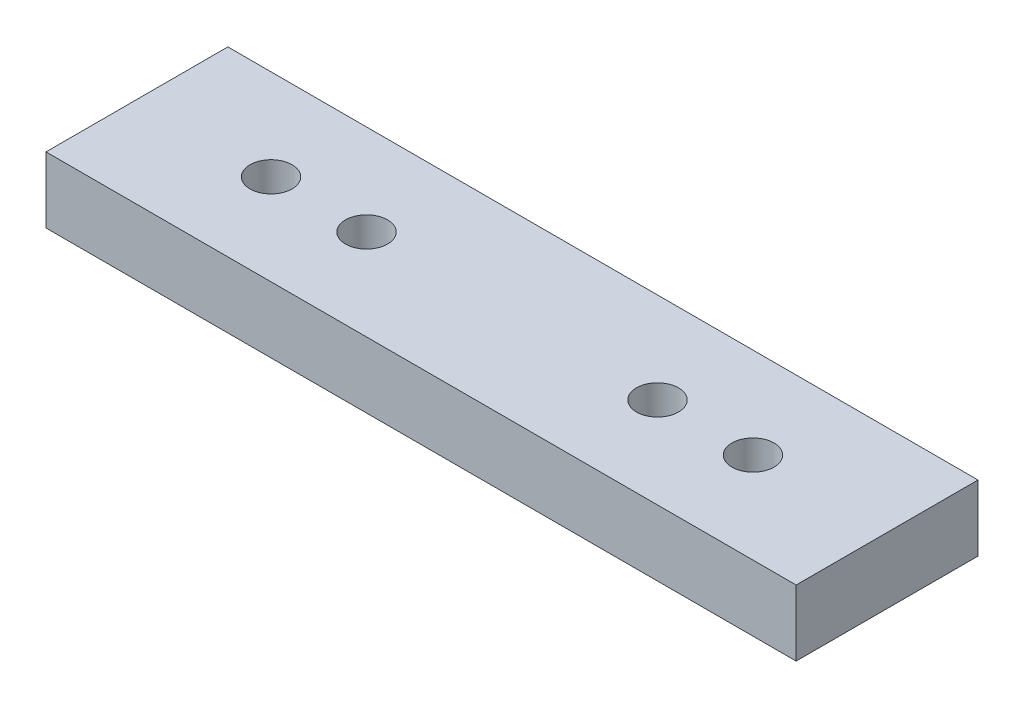
ISO-10303-21;
HEADER;
FILE_DESCRIPTION(('STEP AP214'),'2;1');
FILE_NAME('part.step','',(''),(''),'','','');
FILE_SCHEMA(('AUTOMOTIVE_DESIGN { 1 0 10303 214 1 1 1 1 }'));
ENDSEC;
DATA;
#1=APPLICATION_CONTEXT('core data for automotive mechanical design processes');
#2=APPLICATION_PROTOCOL_DEFINITION('international standard','automotive_design',2000,#1);
#3=PRODUCT_CONTEXT('',#1,'mechanical');
#4=PRODUCT('Part','Part','',(#3));
#5=PRODUCT_RELATED_PRODUCT_CATEGORY('part','',(#4));
#6=PRODUCT_DEFINITION_FORMATION('','',#4);
#7=PRODUCT_DEFINITION_CONTEXT('part definition',#1,'design');
#8=PRODUCT_DEFINITION('design','',#6,#7);
#9=PRODUCT_DEFINITION_SHAPE('','',#8);
#10=(LENGTH_UNIT() NAMED_UNIT(*) SI_UNIT(.MILLI.,.METRE.));
#11=(NAMED_UNIT(*) PLANE_ANGLE_UNIT() SI_UNIT($,.RADIAN.));
#12=(NAMED_UNIT(*) SI_UNIT($,.STERADIAN.) SOLID_ANGLE_UNIT());
#13=UNCERTAINTY_MEASURE_WITH_UNIT(LENGTH_MEASURE(1.E-05),#10,'distance_accuracy_value','');
#14=(GEOMETRIC_REPRESENTATION_CONTEXT(3) GLOBAL_UNCERTAINTY_ASSIGNED_CONTEXT((#13)) GLOBAL_UNIT_ASSIGNED_CONTEXT((#10,
#11,#12)) REPRESENTATION_CONTEXT('',''));
#15=CARTESIAN_POINT('',(0.,0.,0.));
#16=DIRECTION('',(0.,0.,1.));
#17=DIRECTION('',(1.,0.,0.));
#18=AXIS2_PLACEMENT_3D('',#15,#16,#17);
#19=CARTESIAN_POINT('',(20.955,3.683,-5.08));
#20=DIRECTION('',(-1.,0.,0.));
#21=DIRECTION('',(0.,0.,1.));
#22=AXIS2_PLACEMENT_3D('',#19,#20,#21);
#23=PLANE('',#22);
#24=DIRECTION('',(0.,0.,-1.));
#25=VECTOR('',#24,1.);
#26=CARTESIAN_POINT('',(20.955,0.,-5.08));
#27=LINE('',#26,#25);
#28=CARTESIAN_POINT('',(20.955,0.,5.08));
#29=VERTEX_POINT('',#28);
#30=CARTESIAN_POINT('',(20.955,0.,-5.08));
#31=VERTEX_POINT('',#30);
#32=EDGE_CURVE('E102',#29,#31,#27,.T.);
#33=ORIENTED_EDGE('',*,*,#32,.T.);
#34=DIRECTION('',(0.,-1.,0.));
#35=VECTOR('',#34,1.);
#36=CARTESIAN_POINT('',(20.955,3.683,-5.08));
#37=LINE('',#36,#35);
#38=CARTESIAN_POINT('',(20.955,3.683,-5.08));
#39=VERTEX_POINT('',#38);
#40=EDGE_CURVE('E11',#39,#31,#37,.T.);
#41=ORIENTED_EDGE('',*,*,#40,.F.);
#42=DIRECTION('',(0.,0.,-1.));
#43=VECTOR('',#42,1.);
#44=CARTESIAN_POINT('',(20.955,3.683,-5.08));
#45=LINE('',#44,#43);
#46=CARTESIAN_POINT('',(20.955,3.683,5.08));
#47=VERTEX_POINT('',#46);
#48=EDGE_CURVE('E90',#47,#39,#45,.T.);
#49=ORIENTED_EDGE('',*,*,#48,.F.);
#50=DIRECTION('',(0.,-1.,0.));
#51=VECTOR('',#50,1.);
#52=CARTESIAN_POINT('',(20.955,3.683,5.08));
#53=LINE('',#52,#51);
#54=EDGE_CURVE('E98',#47,#29,#53,.T.);
#55=ORIENTED_EDGE('',*,*,#54,.T.);
#56=EDGE_LOOP('',(#33,#41,#49,#55));
#57=FACE_BOUND('',#56,.T.);
#58=ADVANCED_FACE('F39',(#57),#23,.F.);
#59=CARTESIAN_POINT('',(-20.955,3.683,-5.08));
#60=DIRECTION('',(0.,0.,1.));
#61=DIRECTION('',(1.,0.,0.));
#62=AXIS2_PLACEMENT_3D('',#59,#60,#61);
#63=PLANE('',#62);
#64=DIRECTION('',(-1.,0.,0.));
#65=VECTOR('',#64,1.);
#66=CARTESIAN_POINT('',(-20.955,0.,-5.08));
#67=LINE('',#66,#65);
#68=CARTESIAN_POINT('',(-20.955,0.,-5.08));
#69=VERTEX_POINT('',#68);
#70=EDGE_CURVE('E94',#31,#69,#67,.T.);
#71=ORIENTED_EDGE('',*,*,#70,.T.);
#72=DIRECTION('',(0.,-1.,0.));
#73=VECTOR('',#72,1.);
#74=CARTESIAN_POINT('',(-20.955,3.683,-5.08));
#75=LINE('',#74,#73);
#76=CARTESIAN_POINT('',(-20.955,3.683,-5.08));
#77=VERTEX_POINT('',#76);
#78=EDGE_CURVE('E47',#77,#69,#75,.T.);
#79=ORIENTED_EDGE('',*,*,#78,.F.);
#80=DIRECTION('',(-1.,0.,0.));
#81=VECTOR('',#80,1.);
#82=CARTESIAN_POINT('',(-20.955,3.683,-5.08));
#83=LINE('',#82,#81);
#84=EDGE_CURVE('E85',#39,#77,#83,.T.);
#85=ORIENTED_EDGE('',*,*,#84,.F.);
#86=ORIENTED_EDGE('',*,*,#40,.T.);
#87=EDGE_LOOP('',(#71,#79,#85,#86));
#88=FACE_BOUND('',#87,.T.);
#89=ADVANCED_FACE('F93',(#88),#63,.F.);
#90=CARTESIAN_POINT('',(-20.955,3.683,-5.08));
#91=DIRECTION('',(1.,0.,0.));
#92=DIRECTION('',(0.,0.,-1.));
#93=AXIS2_PLACEMENT_3D('',#90,#91,#92);
#94=PLANE('',#93);
#95=DIRECTION('',(0.,0.,1.));
#96=VECTOR('',#95,1.);
#97=CARTESIAN_POINT('',(-20.955,0.,-5.08));
#98=LINE('',#97,#96);
#99=CARTESIAN_POINT('',(-20.955,0.,5.08));
#100=VERTEX_POINT('',#99);
#101=EDGE_CURVE('E72',#69,#100,#98,.T.);
#102=ORIENTED_EDGE('',*,*,#101,.T.);
#103=DIRECTION('',(0.,-1.,0.));
#104=VECTOR('',#103,1.);
#105=CARTESIAN_POINT('',(-20.955,3.683,5.08));
#106=LINE('',#105,#104);
#107=CARTESIAN_POINT('',(-20.955,3.683,5.08));
#108=VERTEX_POINT('',#107);
#109=EDGE_CURVE('E95',#108,#100,#106,.T.);
#110=ORIENTED_EDGE('',*,*,#109,.F.);
#111=DIRECTION('',(0.,0.,1.));
#112=VECTOR('',#111,1.);
#113=CARTESIAN_POINT('',(-20.955,3.683,-5.08));
#114=LINE('',#113,#112);
#115=EDGE_CURVE('E88',#77,#108,#114,.T.);
#116=ORIENTED_EDGE('',*,*,#115,.F.);
#117=ORIENTED_EDGE('',*,*,#78,.T.);
#118=EDGE_LOOP('',(#102,#110,#116,#117));
#119=FACE_BOUND('',#118,.T.);
#120=ADVANCED_FACE('F96',(#119),#94,.F.);
#121=CARTESIAN_POINT('',(-20.955,3.683,5.08));
#122=DIRECTION('',(0.,0.,-1.));
#123=DIRECTION('',(-1.,0.,0.));
#124=AXIS2_PLACEMENT_3D('',#121,#122,#123);
#125=PLANE('',#124);
#126=DIRECTION('',(1.,0.,0.));
#127=VECTOR('',#126,1.);
#128=CARTESIAN_POINT('',(-20.955,0.,5.08));
#129=LINE('',#128,#127);
#130=EDGE_CURVE('E78',#100,#29,#129,.T.);
#131=ORIENTED_EDGE('',*,*,#130,.T.);
#132=ORIENTED_EDGE('',*,*,#54,.F.);
#133=DIRECTION('',(1.,0.,0.));
#134=VECTOR('',#133,1.);
#135=CARTESIAN_POINT('',(-20.955,3.683,5.08));
#136=LINE('',#135,#134);
#137=EDGE_CURVE('E55',#108,#47,#136,.T.);
#138=ORIENTED_EDGE('',*,*,#137,.F.);
#139=ORIENTED_EDGE('',*,*,#109,.T.);
#140=EDGE_LOOP('',(#131,#132,#138,#139));
#141=FACE_BOUND('',#140,.T.);
#142=ADVANCED_FACE('F110',(#141),#125,.F.);
#143=CARTESIAN_POINT('',(0.,3.683,0.));
#144=DIRECTION('',(0.,1.,0.));
#145=DIRECTION('',(0.,0.,1.));
#146=AXIS2_PLACEMENT_3D('',#143,#144,#145);
#147=PLANE('',#146);
#148=CARTESIAN_POINT('',(-13.462,3.683,0.));
#149=DIRECTION('',(0.,-1.,0.));
#150=DIRECTION('',(0.,0.,-1.));
#151=AXIS2_PLACEMENT_3D('',#148,#149,#150);
#152=CIRCLE('',#151,1.17403767481021);
#153=CARTESIAN_POINT('',(-13.462,3.683,-1.17403767481021));
#154=VERTEX_POINT('',#153);
#155=EDGE_CURVE('E105',#154,#154,#152,.T.);
#156=ORIENTED_EDGE('',*,*,#155,.T.);
#157=EDGE_LOOP('',(#156));
#158=FACE_BOUND('',#157,.T.);
#159=CARTESIAN_POINT('',(-8.128,3.683,0.));
#160=DIRECTION('',(0.,-1.,0.));
#161=DIRECTION('',(0.,0.,1.));
#162=AXIS2_PLACEMENT_3D('',#159,#160,#161);
#163=CIRCLE('',#162,1.17403767481021);
#164=CARTESIAN_POINT('',(-8.128,3.683,1.17403767481022));
#165=VERTEX_POINT('',#164);
#166=EDGE_CURVE('E131',#165,#165,#163,.T.);
#167=ORIENTED_EDGE('',*,*,#166,.T.);
#168=EDGE_LOOP('',(#167));
#169=FACE_BOUND('',#168,.T.);
#170=CARTESIAN_POINT('',(8.128,3.683,0.));
#171=DIRECTION('',(0.,-1.,0.));
#172=DIRECTION('',(0.,0.,-1.));
#173=AXIS2_PLACEMENT_3D('',#170,#171,#172);
#174=CIRCLE('',#173,1.17403767481021);
#175=CARTESIAN_POINT('',(8.128,3.683,-1.17403767481021));
#176=VERTEX_POINT('',#175);
#177=EDGE_CURVE('E125',#176,#176,#174,.T.);
#178=ORIENTED_EDGE('',*,*,#177,.T.);
#179=EDGE_LOOP('',(#178));
#180=FACE_BOUND('',#179,.T.);
#181=CARTESIAN_POINT('',(13.462,3.683,0.));
#182=DIRECTION('',(0.,-1.,0.));
#183=DIRECTION('',(0.,0.,1.));
#184=AXIS2_PLACEMENT_3D('',#181,#182,#183);
#185=CIRCLE('',#184,1.17403767481021);
#186=CARTESIAN_POINT('',(13.462,3.683,1.17403767481022));
#187=VERTEX_POINT('',#186);
#188=EDGE_CURVE('E119',#187,#187,#185,.T.);
#189=ORIENTED_EDGE('',*,*,#188,.T.);
#190=EDGE_LOOP('',(#189));
#191=FACE_BOUND('',#190,.T.);
#192=ORIENTED_EDGE('',*,*,#48,.T.);
#193=ORIENTED_EDGE('',*,*,#84,.T.);
#194=ORIENTED_EDGE('',*,*,#115,.T.);
#195=ORIENTED_EDGE('',*,*,#137,.T.);
#196=EDGE_LOOP('',(#192,#193,#194,#195));
#197=FACE_BOUND('',#196,.T.);
#198=ADVANCED_FACE('F86',(#158,#169,#180,#191,#197),#147,.T.);
#199=CARTESIAN_POINT('',(0.,0.,0.));
#200=DIRECTION('',(0.,1.,0.));
#201=DIRECTION('',(0.,0.,1.));
#202=AXIS2_PLACEMENT_3D('',#199,#200,#201);
#203=PLANE('',#202);
#204=CARTESIAN_POINT('',(-13.462,0.,0.));
#205=DIRECTION('',(0.,-1.,0.));
#206=DIRECTION('',(0.,0.,-1.));
#207=AXIS2_PLACEMENT_3D('',#204,#205,#206);
#208=CIRCLE('',#207,1.17403767481021);
#209=CARTESIAN_POINT('',(-13.462,0.,-1.17403767481021));
#210=VERTEX_POINT('',#209);
#211=EDGE_CURVE('E134',#210,#210,#208,.T.);
#212=ORIENTED_EDGE('',*,*,#211,.F.);
#213=EDGE_LOOP('',(#212));
#214=FACE_BOUND('',#213,.T.);
#215=CARTESIAN_POINT('',(-8.128,0.,0.));
#216=DIRECTION('',(0.,-1.,0.));
#217=DIRECTION('',(0.,0.,1.));
#218=AXIS2_PLACEMENT_3D('',#215,#216,#217);
#219=CIRCLE('',#218,1.17403767481021);
#220=CARTESIAN_POINT('',(-8.128,0.,1.17403767481022));
#221=VERTEX_POINT('',#220);
#222=EDGE_CURVE('E128',#221,#221,#219,.T.);
#223=ORIENTED_EDGE('',*,*,#222,.F.);
#224=EDGE_LOOP('',(#223));
#225=FACE_BOUND('',#224,.T.);
#226=CARTESIAN_POINT('',(8.128,0.,0.));
#227=DIRECTION('',(0.,-1.,0.));
#228=DIRECTION('',(0.,0.,-1.));
#229=AXIS2_PLACEMENT_3D('',#226,#227,#228);
#230=CIRCLE('',#229,1.17403767481021);
#231=CARTESIAN_POINT('',(8.128,0.,-1.17403767481021));
#232=VERTEX_POINT('',#231);
#233=EDGE_CURVE('E122',#232,#232,#230,.T.);
#234=ORIENTED_EDGE('',*,*,#233,.F.);
#235=EDGE_LOOP('',(#234));
#236=FACE_BOUND('',#235,.T.);
#237=CARTESIAN_POINT('',(13.462,0.,0.));
#238=DIRECTION('',(0.,-1.,0.));
#239=DIRECTION('',(0.,0.,1.));
#240=AXIS2_PLACEMENT_3D('',#237,#238,#239);
#241=CIRCLE('',#240,1.17403767481021);
#242=CARTESIAN_POINT('',(13.462,0.,1.17403767481022));
#243=VERTEX_POINT('',#242);
#244=EDGE_CURVE('E116',#243,#243,#241,.T.);
#245=ORIENTED_EDGE('',*,*,#244,.F.);
#246=EDGE_LOOP('',(#245));
#247=FACE_BOUND('',#246,.T.);
#248=ORIENTED_EDGE('',*,*,#32,.F.);
#249=ORIENTED_EDGE('',*,*,#130,.F.);
#250=ORIENTED_EDGE('',*,*,#101,.F.);
#251=ORIENTED_EDGE('',*,*,#70,.F.);
#252=EDGE_LOOP('',(#248,#249,#250,#251));
#253=FACE_BOUND('',#252,.T.);
#254=ADVANCED_FACE('F113',(#214,#225,#236,#247,#253),#203,.F.);
#255=CARTESIAN_POINT('',(13.462,3.683,0.));
#256=DIRECTION('',(0.,-1.,0.));
#257=DIRECTION('',(0.,0.,-1.));
#258=AXIS2_PLACEMENT_3D('',#255,#256,#257);
#259=CYLINDRICAL_SURFACE('',#258,1.17403767481021);
#260=ORIENTED_EDGE('',*,*,#188,.F.);
#261=EDGE_LOOP('',(#260));
#262=FACE_BOUND('',#261,.T.);
#263=ORIENTED_EDGE('',*,*,#244,.T.);
#264=EDGE_LOOP('',(#263));
#265=FACE_BOUND('',#264,.T.);
#266=ADVANCED_FACE('F151',(#262,#265),#259,.F.);
#267=CARTESIAN_POINT('',(8.128,3.683,0.));
#268=DIRECTION('',(0.,-1.,0.));
#269=DIRECTION('',(0.,0.,-1.));
#270=AXIS2_PLACEMENT_3D('',#267,#268,#269);
#271=CYLINDRICAL_SURFACE('',#270,1.17403767481021);
#272=ORIENTED_EDGE('',*,*,#177,.F.);
#273=EDGE_LOOP('',(#272));
#274=FACE_BOUND('',#273,.T.);
#275=ORIENTED_EDGE('',*,*,#233,.T.);
#276=EDGE_LOOP('',(#275));
#277=FACE_BOUND('',#276,.T.);
#278=ADVANCED_FACE('F160',(#274,#277),#271,.F.);
#279=CARTESIAN_POINT('',(-8.128,3.683,0.));
#280=DIRECTION('',(0.,-1.,0.));
#281=DIRECTION('',(0.,0.,-1.));
#282=AXIS2_PLACEMENT_3D('',#279,#280,#281);
#283=CYLINDRICAL_SURFACE('',#282,1.17403767481021);
#284=ORIENTED_EDGE('',*,*,#166,.F.);
#285=EDGE_LOOP('',(#284));
#286=FACE_BOUND('',#285,.T.);
#287=ORIENTED_EDGE('',*,*,#222,.T.);
#288=EDGE_LOOP('',(#287));
#289=FACE_BOUND('',#288,.T.);
#290=ADVANCED_FACE('F145',(#286,#289),#283,.F.);
#291=CARTESIAN_POINT('',(-13.462,3.683,0.));
#292=DIRECTION('',(0.,-1.,0.));
#293=DIRECTION('',(0.,0.,-1.));
#294=AXIS2_PLACEMENT_3D('',#291,#292,#293);
#295=CYLINDRICAL_SURFACE('',#294,1.17403767481021);
#296=ORIENTED_EDGE('',*,*,#155,.F.);
#297=EDGE_LOOP('',(#296));
#298=FACE_BOUND('',#297,.T.);
#299=ORIENTED_EDGE('',*,*,#211,.T.);
#300=EDGE_LOOP('',(#299));
#301=FACE_BOUND('',#300,.T.);
#302=ADVANCED_FACE('F142',(#298,#301),#295,.F.);
#303=CLOSED_SHELL('',(#58,#89,#120,#142,#198,#254,#266,#278,#290,#302));
#304=MANIFOLD_SOLID_BREP('B2',#303);
#305=ADVANCED_BREP_SHAPE_REPRESENTATION('',(#18,#304),#14);
#306=SHAPE_DEFINITION_REPRESENTATION(#9,#305);
ENDSEC;
END-ISO-10303-21;
